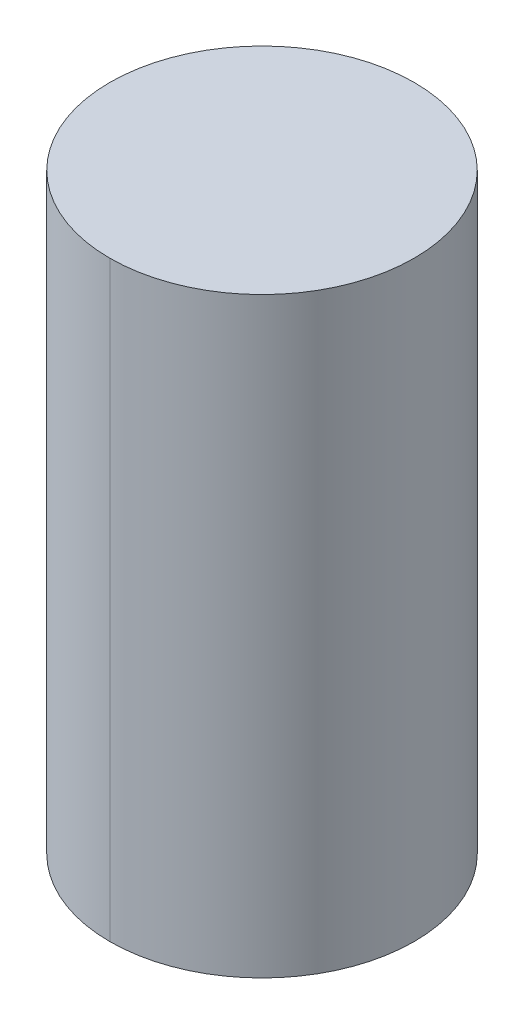
ISO-10303-21;
HEADER;
FILE_DESCRIPTION(('STEP AP214'),'2;1');
FILE_NAME('part.step','',(''),(''),'','','');
FILE_SCHEMA(('AUTOMOTIVE_DESIGN { 1 0 10303 214 1 1 1 1 }'));
ENDSEC;
DATA;
#1=APPLICATION_CONTEXT('core data for automotive mechanical design processes');
#2=APPLICATION_PROTOCOL_DEFINITION('international standard','automotive_design',2000,#1);
#3=PRODUCT_CONTEXT('',#1,'mechanical');
#4=PRODUCT('Part','Part','',(#3));
#5=PRODUCT_RELATED_PRODUCT_CATEGORY('part','',(#4));
#6=PRODUCT_DEFINITION_FORMATION('','',#4);
#7=PRODUCT_DEFINITION_CONTEXT('part definition',#1,'design');
#8=PRODUCT_DEFINITION('design','',#6,#7);
#9=PRODUCT_DEFINITION_SHAPE('','',#8);
#10=(LENGTH_UNIT() NAMED_UNIT(*) SI_UNIT(.MILLI.,.METRE.));
#11=(NAMED_UNIT(*) PLANE_ANGLE_UNIT() SI_UNIT($,.RADIAN.));
#12=(NAMED_UNIT(*) SI_UNIT($,.STERADIAN.) SOLID_ANGLE_UNIT());
#13=UNCERTAINTY_MEASURE_WITH_UNIT(LENGTH_MEASURE(1.E-05),#10,'distance_accuracy_value','');
#14=(GEOMETRIC_REPRESENTATION_CONTEXT(3) GLOBAL_UNCERTAINTY_ASSIGNED_CONTEXT((#13)) GLOBAL_UNIT_ASSIGNED_CONTEXT((#10,
#11,#12)) REPRESENTATION_CONTEXT('',''));
#15=CARTESIAN_POINT('',(0.,0.,0.));
#16=DIRECTION('',(0.,0.,1.));
#17=DIRECTION('',(1.,0.,0.));
#18=AXIS2_PLACEMENT_3D('',#15,#16,#17);
#19=CARTESIAN_POINT('',(8.50000011920929,8.01396547097236,2.5));
#20=DIRECTION('',(0.,-1.,0.));
#21=DIRECTION('',(-0.707106781186548,0.,0.707106781186547));
#22=AXIS2_PLACEMENT_3D('',#19,#20,#21);
#23=CYLINDRICAL_SURFACE('',#22,0.5);
#24=CARTESIAN_POINT('',(8.50000011920929,6.55586150390983,2.5));
#25=DIRECTION('',(0.,1.,0.));
#26=DIRECTION('',(-0.707106781186548,0.,0.707106781186547));
#27=AXIS2_PLACEMENT_3D('',#24,#25,#26);
#28=CIRCLE('',#27,0.5);
#29=CARTESIAN_POINT('',(8.50000011920929,6.55586150390983,2.));
#30=VERTEX_POINT('',#29);
#31=CARTESIAN_POINT('',(8.50000011920929,6.55586150390983,3.));
#32=VERTEX_POINT('',#31);
#33=EDGE_CURVE('E21',#30,#32,#28,.T.);
#34=ORIENTED_EDGE('',*,*,#33,.T.);
#35=DIRECTION('',(0.,1.,0.));
#36=VECTOR('',#35,1.);
#37=CARTESIAN_POINT('',(8.50000011920929,8.01396547097236,3.));
#38=LINE('',#37,#36);
#39=CARTESIAN_POINT('',(8.50000011920929,8.50000012665987,3.));
#40=VERTEX_POINT('',#39);
#41=EDGE_CURVE('E55',#32,#40,#38,.T.);
#42=ORIENTED_EDGE('',*,*,#41,.T.);
#43=CARTESIAN_POINT('',(8.50000011920929,8.50000012665987,2.5));
#44=DIRECTION('',(0.,-1.,0.));
#45=DIRECTION('',(-0.707106781186548,0.,-0.707106781186547));
#46=AXIS2_PLACEMENT_3D('',#43,#44,#45);
#47=CIRCLE('',#46,0.5);
#48=CARTESIAN_POINT('',(8.50000011920929,8.50000012665987,2.));
#49=VERTEX_POINT('',#48);
#50=EDGE_CURVE('E11',#40,#49,#47,.T.);
#51=ORIENTED_EDGE('',*,*,#50,.T.);
#52=DIRECTION('',(0.,-1.,0.));
#53=VECTOR('',#52,1.);
#54=CARTESIAN_POINT('',(8.50000011920929,8.01396547097236,2.));
#55=LINE('',#54,#53);
#56=EDGE_CURVE('E28',#49,#30,#55,.T.);
#57=ORIENTED_EDGE('',*,*,#56,.T.);
#58=EDGE_LOOP('',(#34,#42,#51,#57));
#59=FACE_BOUND('',#58,.T.);
#60=ADVANCED_FACE('F17',(#59),#23,.T.);
#61=CARTESIAN_POINT('',(9.00000013411045,8.50000012665987,2.));
#62=DIRECTION('',(0.,1.,0.));
#63=DIRECTION('',(1.,0.,0.));
#64=AXIS2_PLACEMENT_3D('',#61,#62,#63);
#65=PLANE('',#64);
#66=CARTESIAN_POINT('',(8.50000013411045,8.50000012665987,2.5));
#67=DIRECTION('',(0.,-1.,0.));
#68=DIRECTION('',(0.707106781186548,0.,0.707106781186547));
#69=AXIS2_PLACEMENT_3D('',#66,#67,#68);
#70=CIRCLE('',#69,0.5);
#71=EDGE_CURVE('E59',#49,#40,#70,.T.);
#72=ORIENTED_EDGE('',*,*,#71,.F.);
#73=ORIENTED_EDGE('',*,*,#50,.F.);
#74=EDGE_LOOP('',(#72,#73));
#75=FACE_BOUND('',#74,.T.);
#76=ADVANCED_FACE('F19',(#75),#65,.T.);
#77=CARTESIAN_POINT('',(8.50000013411045,7.04189615959734,2.5));
#78=DIRECTION('',(0.,1.,0.));
#79=DIRECTION('',(0.707106781186548,0.,0.707106781186547));
#80=AXIS2_PLACEMENT_3D('',#77,#78,#79);
#81=CYLINDRICAL_SURFACE('',#80,0.5);
#82=ORIENTED_EDGE('',*,*,#71,.T.);
#83=ORIENTED_EDGE('',*,*,#41,.F.);
#84=CARTESIAN_POINT('',(8.50000013411045,6.55586150390983,2.5));
#85=DIRECTION('',(0.,1.,0.));
#86=DIRECTION('',(0.707106781186548,0.,-0.707106781186547));
#87=AXIS2_PLACEMENT_3D('',#84,#85,#86);
#88=CIRCLE('',#87,0.5);
#89=EDGE_CURVE('E58',#32,#30,#88,.T.);
#90=ORIENTED_EDGE('',*,*,#89,.T.);
#91=ORIENTED_EDGE('',*,*,#56,.F.);
#92=EDGE_LOOP('',(#82,#83,#90,#91));
#93=FACE_BOUND('',#92,.T.);
#94=ADVANCED_FACE('F56',(#93),#81,.T.);
#95=CARTESIAN_POINT('',(8.00000011920929,6.55586150390983,2.));
#96=DIRECTION('',(0.,-1.,0.));
#97=DIRECTION('',(0.,0.,-1.));
#98=AXIS2_PLACEMENT_3D('',#95,#96,#97);
#99=PLANE('',#98);
#100=ORIENTED_EDGE('',*,*,#89,.F.);
#101=ORIENTED_EDGE('',*,*,#33,.F.);
#102=EDGE_LOOP('',(#100,#101));
#103=FACE_BOUND('',#102,.T.);
#104=ADVANCED_FACE('F64',(#103),#99,.T.);
#105=CLOSED_SHELL('',(#60,#76,#94,#104));
#106=MANIFOLD_SOLID_BREP('B1',#105);
#107=ADVANCED_BREP_SHAPE_REPRESENTATION('',(#18,#106),#14);
#108=SHAPE_DEFINITION_REPRESENTATION(#9,#107);
ENDSEC;
END-ISO-10303-21;
